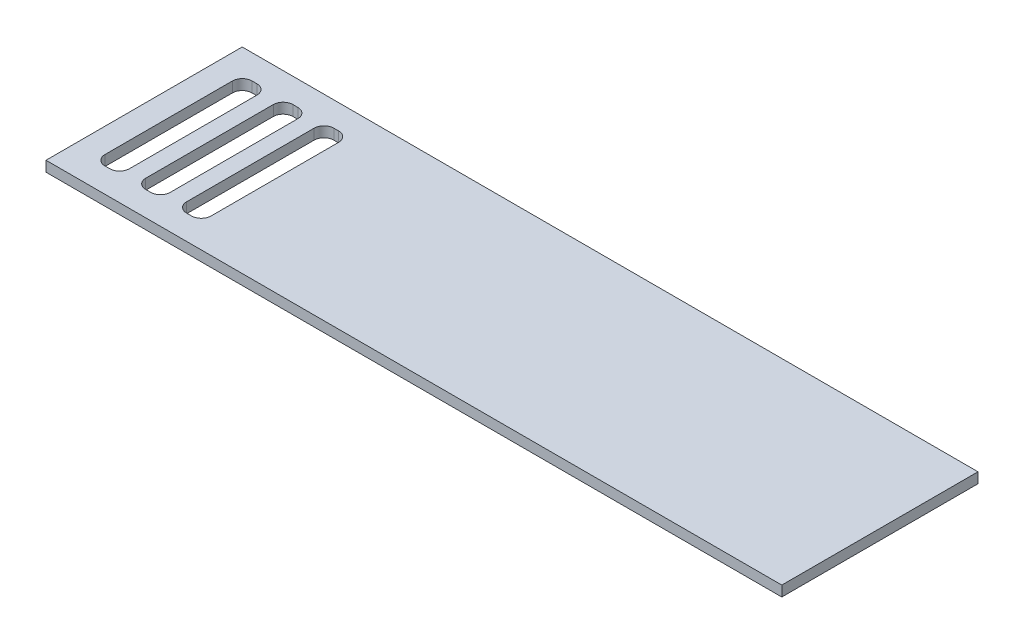
ISO-10303-21;
HEADER;
FILE_DESCRIPTION(('STEP AP214'),'2;1');
FILE_NAME('part.step','',(''),(''),'','','');
FILE_SCHEMA(('AUTOMOTIVE_DESIGN { 1 0 10303 214 1 1 1 1 }'));
ENDSEC;
DATA;
#1=APPLICATION_CONTEXT('core data for automotive mechanical design processes');
#2=APPLICATION_PROTOCOL_DEFINITION('international standard','automotive_design',2000,#1);
#3=PRODUCT_CONTEXT('',#1,'mechanical');
#4=PRODUCT('Part','Part','',(#3));
#5=PRODUCT_RELATED_PRODUCT_CATEGORY('part','',(#4));
#6=PRODUCT_DEFINITION_FORMATION('','',#4);
#7=PRODUCT_DEFINITION_CONTEXT('part definition',#1,'design');
#8=PRODUCT_DEFINITION('design','',#6,#7);
#9=PRODUCT_DEFINITION_SHAPE('','',#8);
#10=(LENGTH_UNIT() NAMED_UNIT(*) SI_UNIT(.MILLI.,.METRE.));
#11=(NAMED_UNIT(*) PLANE_ANGLE_UNIT() SI_UNIT($,.RADIAN.));
#12=(NAMED_UNIT(*) SI_UNIT($,.STERADIAN.) SOLID_ANGLE_UNIT());
#13=UNCERTAINTY_MEASURE_WITH_UNIT(LENGTH_MEASURE(1.E-05),#10,'distance_accuracy_value','');
#14=(GEOMETRIC_REPRESENTATION_CONTEXT(3) GLOBAL_UNCERTAINTY_ASSIGNED_CONTEXT((#13)) GLOBAL_UNIT_ASSIGNED_CONTEXT((#10,
#11,#12)) REPRESENTATION_CONTEXT('',''));
#15=CARTESIAN_POINT('',(0.,0.,0.));
#16=DIRECTION('',(0.,0.,1.));
#17=DIRECTION('',(1.,0.,0.));
#18=AXIS2_PLACEMENT_3D('',#15,#16,#17);
#19=CARTESIAN_POINT('',(0.,6.35,0.));
#20=DIRECTION('',(1.,0.,0.));
#21=DIRECTION('',(0.,0.,-1.));
#22=AXIS2_PLACEMENT_3D('',#19,#20,#21);
#23=PLANE('',#22);
#24=DIRECTION('',(0.,0.,1.));
#25=VECTOR('',#24,1.);
#26=CARTESIAN_POINT('',(0.,0.,0.));
#27=LINE('',#26,#25);
#28=CARTESIAN_POINT('',(0.,0.,-120.));
#29=VERTEX_POINT('',#28);
#30=CARTESIAN_POINT('',(0.,0.,0.));
#31=VERTEX_POINT('',#30);
#32=EDGE_CURVE('E259',#29,#31,#27,.T.);
#33=ORIENTED_EDGE('',*,*,#32,.T.);
#34=DIRECTION('',(0.,-1.,0.));
#35=VECTOR('',#34,1.);
#36=CARTESIAN_POINT('',(0.,6.35,0.));
#37=LINE('',#36,#35);
#38=CARTESIAN_POINT('',(0.,6.35,0.));
#39=VERTEX_POINT('',#38);
#40=EDGE_CURVE('E238',#39,#31,#37,.T.);
#41=ORIENTED_EDGE('',*,*,#40,.F.);
#42=DIRECTION('',(0.,0.,1.));
#43=VECTOR('',#42,1.);
#44=CARTESIAN_POINT('',(0.,6.35,0.));
#45=LINE('',#44,#43);
#46=CARTESIAN_POINT('',(0.,6.35,-120.));
#47=VERTEX_POINT('',#46);
#48=EDGE_CURVE('E246',#47,#39,#45,.T.);
#49=ORIENTED_EDGE('',*,*,#48,.F.);
#50=DIRECTION('',(0.,-1.,0.));
#51=VECTOR('',#50,1.);
#52=CARTESIAN_POINT('',(0.,6.35,-120.));
#53=LINE('',#52,#51);
#54=EDGE_CURVE('E515',#47,#29,#53,.T.);
#55=ORIENTED_EDGE('',*,*,#54,.T.);
#56=EDGE_LOOP('',(#33,#41,#49,#55));
#57=FACE_BOUND('',#56,.T.);
#58=ADVANCED_FACE('F48',(#57),#23,.F.);
#59=CARTESIAN_POINT('',(0.,6.35,0.));
#60=DIRECTION('',(0.,0.,-1.));
#61=DIRECTION('',(-1.,0.,0.));
#62=AXIS2_PLACEMENT_3D('',#59,#60,#61);
#63=PLANE('',#62);
#64=DIRECTION('',(1.,0.,0.));
#65=VECTOR('',#64,1.);
#66=CARTESIAN_POINT('',(0.,0.,0.));
#67=LINE('',#66,#65);
#68=CARTESIAN_POINT('',(450.,0.,0.));
#69=VERTEX_POINT('',#68);
#70=EDGE_CURVE('E518',#31,#69,#67,.T.);
#71=ORIENTED_EDGE('',*,*,#70,.T.);
#72=DIRECTION('',(0.,-1.,0.));
#73=VECTOR('',#72,1.);
#74=CARTESIAN_POINT('',(450.,6.35,0.));
#75=LINE('',#74,#73);
#76=CARTESIAN_POINT('',(450.,6.35,0.));
#77=VERTEX_POINT('',#76);
#78=EDGE_CURVE('E241',#77,#69,#75,.T.);
#79=ORIENTED_EDGE('',*,*,#78,.F.);
#80=DIRECTION('',(1.,0.,0.));
#81=VECTOR('',#80,1.);
#82=CARTESIAN_POINT('',(0.,6.35,0.));
#83=LINE('',#82,#81);
#84=EDGE_CURVE('E234',#39,#77,#83,.T.);
#85=ORIENTED_EDGE('',*,*,#84,.F.);
#86=ORIENTED_EDGE('',*,*,#40,.T.);
#87=EDGE_LOOP('',(#71,#79,#85,#86));
#88=FACE_BOUND('',#87,.T.);
#89=ADVANCED_FACE('F236',(#88),#63,.F.);
#90=CARTESIAN_POINT('',(450.,6.35,0.));
#91=DIRECTION('',(-1.,0.,0.));
#92=DIRECTION('',(0.,0.,1.));
#93=AXIS2_PLACEMENT_3D('',#90,#91,#92);
#94=PLANE('',#93);
#95=DIRECTION('',(0.,0.,-1.));
#96=VECTOR('',#95,1.);
#97=CARTESIAN_POINT('',(450.,0.,0.));
#98=LINE('',#97,#96);
#99=CARTESIAN_POINT('',(450.,0.,-120.));
#100=VERTEX_POINT('',#99);
#101=EDGE_CURVE('E521',#69,#100,#98,.T.);
#102=ORIENTED_EDGE('',*,*,#101,.T.);
#103=DIRECTION('',(0.,-1.,0.));
#104=VECTOR('',#103,1.);
#105=CARTESIAN_POINT('',(450.,6.35,-120.));
#106=LINE('',#105,#104);
#107=CARTESIAN_POINT('',(450.,6.35,-120.));
#108=VERTEX_POINT('',#107);
#109=EDGE_CURVE('E267',#108,#100,#106,.T.);
#110=ORIENTED_EDGE('',*,*,#109,.F.);
#111=DIRECTION('',(0.,0.,-1.));
#112=VECTOR('',#111,1.);
#113=CARTESIAN_POINT('',(450.,6.35,0.));
#114=LINE('',#113,#112);
#115=EDGE_CURVE('E245',#77,#108,#114,.T.);
#116=ORIENTED_EDGE('',*,*,#115,.F.);
#117=ORIENTED_EDGE('',*,*,#78,.T.);
#118=EDGE_LOOP('',(#102,#110,#116,#117));
#119=FACE_BOUND('',#118,.T.);
#120=ADVANCED_FACE('F536',(#119),#94,.F.);
#121=CARTESIAN_POINT('',(0.,6.35,-120.));
#122=DIRECTION('',(0.,0.,1.));
#123=DIRECTION('',(1.,0.,0.));
#124=AXIS2_PLACEMENT_3D('',#121,#122,#123);
#125=PLANE('',#124);
#126=DIRECTION('',(-1.,0.,0.));
#127=VECTOR('',#126,1.);
#128=CARTESIAN_POINT('',(0.,0.,-120.));
#129=LINE('',#128,#127);
#130=EDGE_CURVE('E256',#100,#29,#129,.T.);
#131=ORIENTED_EDGE('',*,*,#130,.T.);
#132=ORIENTED_EDGE('',*,*,#54,.F.);
#133=DIRECTION('',(-1.,0.,0.));
#134=VECTOR('',#133,1.);
#135=CARTESIAN_POINT('',(0.,6.35,-120.));
#136=LINE('',#135,#134);
#137=EDGE_CURVE('E251',#108,#47,#136,.T.);
#138=ORIENTED_EDGE('',*,*,#137,.F.);
#139=ORIENTED_EDGE('',*,*,#109,.T.);
#140=EDGE_LOOP('',(#131,#132,#138,#139));
#141=FACE_BOUND('',#140,.T.);
#142=ADVANCED_FACE('F532',(#141),#125,.F.);
#143=CARTESIAN_POINT('',(0.,6.35,0.));
#144=DIRECTION('',(0.,-1.,0.));
#145=DIRECTION('',(0.,0.,-1.));
#146=AXIS2_PLACEMENT_3D('',#143,#144,#145);
#147=PLANE('',#146);
#148=DIRECTION('',(-1.,0.,0.));
#149=VECTOR('',#148,1.);
#150=CARTESIAN_POINT('',(0.,6.35,-15.));
#151=LINE('',#150,#149);
#152=CARTESIAN_POINT('',(24.,6.35,-15.));
#153=VERTEX_POINT('',#152);
#154=CARTESIAN_POINT('',(21.,6.35,-15.));
#155=VERTEX_POINT('',#154);
#156=EDGE_CURVE('E499',#153,#155,#151,.T.);
#157=ORIENTED_EDGE('',*,*,#156,.T.);
#158=CARTESIAN_POINT('',(21.,6.35,-21.));
#159=DIRECTION('',(0.,-1.,0.));
#160=DIRECTION('',(0.,0.,-1.));
#161=AXIS2_PLACEMENT_3D('',#158,#159,#160);
#162=CIRCLE('',#161,6.);
#163=CARTESIAN_POINT('',(15.,6.35,-21.));
#164=VERTEX_POINT('',#163);
#165=EDGE_CURVE('E380',#155,#164,#162,.T.);
#166=ORIENTED_EDGE('',*,*,#165,.T.);
#167=DIRECTION('',(0.,0.,-1.));
#168=VECTOR('',#167,1.);
#169=CARTESIAN_POINT('',(15.,6.35,0.));
#170=LINE('',#169,#168);
#171=CARTESIAN_POINT('',(15.,6.35,-99.));
#172=VERTEX_POINT('',#171);
#173=EDGE_CURVE('E495',#164,#172,#170,.T.);
#174=ORIENTED_EDGE('',*,*,#173,.T.);
#175=CARTESIAN_POINT('',(21.,6.35,-99.));
#176=DIRECTION('',(0.,-1.,0.));
#177=DIRECTION('',(0.,0.,-1.));
#178=AXIS2_PLACEMENT_3D('',#175,#176,#177);
#179=CIRCLE('',#178,6.);
#180=CARTESIAN_POINT('',(21.,6.35,-105.));
#181=VERTEX_POINT('',#180);
#182=EDGE_CURVE('E386',#172,#181,#179,.T.);
#183=ORIENTED_EDGE('',*,*,#182,.T.);
#184=DIRECTION('',(1.,0.,0.));
#185=VECTOR('',#184,1.);
#186=CARTESIAN_POINT('',(0.,6.35,-105.));
#187=LINE('',#186,#185);
#188=CARTESIAN_POINT('',(24.,6.35,-105.));
#189=VERTEX_POINT('',#188);
#190=EDGE_CURVE('E507',#181,#189,#187,.T.);
#191=ORIENTED_EDGE('',*,*,#190,.T.);
#192=CARTESIAN_POINT('',(24.,6.35,-99.));
#193=DIRECTION('',(0.,-1.,0.));
#194=DIRECTION('',(0.,0.,-1.));
#195=AXIS2_PLACEMENT_3D('',#192,#193,#194);
#196=CIRCLE('',#195,6.);
#197=CARTESIAN_POINT('',(30.,6.35,-99.));
#198=VERTEX_POINT('',#197);
#199=EDGE_CURVE('E403',#189,#198,#196,.T.);
#200=ORIENTED_EDGE('',*,*,#199,.T.);
#201=DIRECTION('',(0.,0.,1.));
#202=VECTOR('',#201,1.);
#203=CARTESIAN_POINT('',(30.,6.35,0.));
#204=LINE('',#203,#202);
#205=CARTESIAN_POINT('',(30.,6.35,-21.));
#206=VERTEX_POINT('',#205);
#207=EDGE_CURVE('E503',#198,#206,#204,.T.);
#208=ORIENTED_EDGE('',*,*,#207,.T.);
#209=CARTESIAN_POINT('',(24.,6.35,-21.));
#210=DIRECTION('',(0.,-1.,0.));
#211=DIRECTION('',(0.,0.,-1.));
#212=AXIS2_PLACEMENT_3D('',#209,#210,#211);
#213=CIRCLE('',#212,6.);
#214=EDGE_CURVE('E362',#206,#153,#213,.T.);
#215=ORIENTED_EDGE('',*,*,#214,.T.);
#216=EDGE_LOOP('',(#157,#166,#174,#183,#191,#200,#208,#215));
#217=FACE_BOUND('',#216,.T.);
#218=DIRECTION('',(-1.,0.,0.));
#219=VECTOR('',#218,1.);
#220=CARTESIAN_POINT('',(0.,6.35,-15.));
#221=LINE('',#220,#219);
#222=CARTESIAN_POINT('',(74.,6.35,-15.));
#223=VERTEX_POINT('',#222);
#224=CARTESIAN_POINT('',(71.,6.35,-15.));
#225=VERTEX_POINT('',#224);
#226=EDGE_CURVE('E427',#223,#225,#221,.T.);
#227=ORIENTED_EDGE('',*,*,#226,.T.);
#228=CARTESIAN_POINT('',(71.,6.35,-21.));
#229=DIRECTION('',(0.,-1.,0.));
#230=DIRECTION('',(0.,0.,-1.));
#231=AXIS2_PLACEMENT_3D('',#228,#229,#230);
#232=CIRCLE('',#231,6.);
#233=CARTESIAN_POINT('',(65.,6.35,-21.));
#234=VERTEX_POINT('',#233);
#235=EDGE_CURVE('E368',#225,#234,#232,.T.);
#236=ORIENTED_EDGE('',*,*,#235,.T.);
#237=DIRECTION('',(0.,0.,-1.));
#238=VECTOR('',#237,1.);
#239=CARTESIAN_POINT('',(65.,6.35,0.));
#240=LINE('',#239,#238);
#241=CARTESIAN_POINT('',(65.,6.35,-99.));
#242=VERTEX_POINT('',#241);
#243=EDGE_CURVE('E488',#234,#242,#240,.T.);
#244=ORIENTED_EDGE('',*,*,#243,.T.);
#245=CARTESIAN_POINT('',(71.,6.35,-99.));
#246=DIRECTION('',(0.,-1.,0.));
#247=DIRECTION('',(0.,0.,-1.));
#248=AXIS2_PLACEMENT_3D('',#245,#246,#247);
#249=CIRCLE('',#248,6.);
#250=CARTESIAN_POINT('',(71.,6.35,-105.));
#251=VERTEX_POINT('',#250);
#252=EDGE_CURVE('E71',#242,#251,#249,.T.);
#253=ORIENTED_EDGE('',*,*,#252,.T.);
#254=DIRECTION('',(1.,0.,0.));
#255=VECTOR('',#254,1.);
#256=CARTESIAN_POINT('',(0.,6.35,-105.));
#257=LINE('',#256,#255);
#258=CARTESIAN_POINT('',(74.,6.35,-105.));
#259=VERTEX_POINT('',#258);
#260=EDGE_CURVE('E420',#251,#259,#257,.T.);
#261=ORIENTED_EDGE('',*,*,#260,.T.);
#262=CARTESIAN_POINT('',(74.,6.35,-99.));
#263=DIRECTION('',(0.,-1.,0.));
#264=DIRECTION('',(0.,0.,-1.));
#265=AXIS2_PLACEMENT_3D('',#262,#263,#264);
#266=CIRCLE('',#265,6.);
#267=CARTESIAN_POINT('',(80.,6.35,-99.));
#268=VERTEX_POINT('',#267);
#269=EDGE_CURVE('E57',#259,#268,#266,.T.);
#270=ORIENTED_EDGE('',*,*,#269,.T.);
#271=DIRECTION('',(0.,0.,1.));
#272=VECTOR('',#271,1.);
#273=CARTESIAN_POINT('',(80.,6.35,0.));
#274=LINE('',#273,#272);
#275=CARTESIAN_POINT('',(80.,6.35,-21.));
#276=VERTEX_POINT('',#275);
#277=EDGE_CURVE('E419',#268,#276,#274,.T.);
#278=ORIENTED_EDGE('',*,*,#277,.T.);
#279=CARTESIAN_POINT('',(74.,6.35,-21.));
#280=DIRECTION('',(0.,-1.,0.));
#281=DIRECTION('',(0.,0.,-1.));
#282=AXIS2_PLACEMENT_3D('',#279,#280,#281);
#283=CIRCLE('',#282,6.);
#284=EDGE_CURVE('E350',#276,#223,#283,.T.);
#285=ORIENTED_EDGE('',*,*,#284,.T.);
#286=EDGE_LOOP('',(#227,#236,#244,#253,#261,#270,#278,#285));
#287=FACE_BOUND('',#286,.T.);
#288=DIRECTION('',(0.,0.,1.));
#289=VECTOR('',#288,1.);
#290=CARTESIAN_POINT('',(55.,6.35,0.));
#291=LINE('',#290,#289);
#292=CARTESIAN_POINT('',(55.,6.35,-99.));
#293=VERTEX_POINT('',#292);
#294=CARTESIAN_POINT('',(55.,6.35,-21.));
#295=VERTEX_POINT('',#294);
#296=EDGE_CURVE('E475',#293,#295,#291,.T.);
#297=ORIENTED_EDGE('',*,*,#296,.T.);
#298=CARTESIAN_POINT('',(49.,6.35,-21.));
#299=DIRECTION('',(0.,-1.,0.));
#300=DIRECTION('',(0.,0.,-1.));
#301=AXIS2_PLACEMENT_3D('',#298,#299,#300);
#302=CIRCLE('',#301,6.);
#303=CARTESIAN_POINT('',(49.,6.35,-15.));
#304=VERTEX_POINT('',#303);
#305=EDGE_CURVE('E356',#295,#304,#302,.T.);
#306=ORIENTED_EDGE('',*,*,#305,.T.);
#307=DIRECTION('',(-1.,0.,0.));
#308=VECTOR('',#307,1.);
#309=CARTESIAN_POINT('',(0.,6.35,-15.));
#310=LINE('',#309,#308);
#311=CARTESIAN_POINT('',(46.,6.35,-15.));
#312=VERTEX_POINT('',#311);
#313=EDGE_CURVE('E471',#304,#312,#310,.T.);
#314=ORIENTED_EDGE('',*,*,#313,.T.);
#315=CARTESIAN_POINT('',(46.,6.35,-21.));
#316=DIRECTION('',(0.,-1.,0.));
#317=DIRECTION('',(0.,0.,-1.));
#318=AXIS2_PLACEMENT_3D('',#315,#316,#317);
#319=CIRCLE('',#318,6.);
#320=CARTESIAN_POINT('',(40.,6.35,-21.));
#321=VERTEX_POINT('',#320);
#322=EDGE_CURVE('E374',#312,#321,#319,.T.);
#323=ORIENTED_EDGE('',*,*,#322,.T.);
#324=DIRECTION('',(0.,0.,-1.));
#325=VECTOR('',#324,1.);
#326=CARTESIAN_POINT('',(40.,6.35,0.));
#327=LINE('',#326,#325);
#328=CARTESIAN_POINT('',(40.,6.35,-99.));
#329=VERTEX_POINT('',#328);
#330=EDGE_CURVE('E484',#321,#329,#327,.T.);
#331=ORIENTED_EDGE('',*,*,#330,.T.);
#332=CARTESIAN_POINT('',(46.,6.35,-99.));
#333=DIRECTION('',(0.,-1.,0.));
#334=DIRECTION('',(0.,0.,-1.));
#335=AXIS2_PLACEMENT_3D('',#332,#333,#334);
#336=CIRCLE('',#335,6.);
#337=CARTESIAN_POINT('',(46.,6.35,-105.));
#338=VERTEX_POINT('',#337);
#339=EDGE_CURVE('E392',#329,#338,#336,.T.);
#340=ORIENTED_EDGE('',*,*,#339,.T.);
#341=DIRECTION('',(1.,0.,0.));
#342=VECTOR('',#341,1.);
#343=CARTESIAN_POINT('',(0.,6.35,-105.));
#344=LINE('',#343,#342);
#345=CARTESIAN_POINT('',(49.,6.35,-105.));
#346=VERTEX_POINT('',#345);
#347=EDGE_CURVE('E480',#338,#346,#344,.T.);
#348=ORIENTED_EDGE('',*,*,#347,.T.);
#349=CARTESIAN_POINT('',(49.,6.35,-99.));
#350=DIRECTION('',(0.,-1.,0.));
#351=DIRECTION('',(0.,0.,-1.));
#352=AXIS2_PLACEMENT_3D('',#349,#350,#351);
#353=CIRCLE('',#352,6.);
#354=EDGE_CURVE('E409',#346,#293,#353,.T.);
#355=ORIENTED_EDGE('',*,*,#354,.T.);
#356=EDGE_LOOP('',(#297,#306,#314,#323,#331,#340,#348,#355));
#357=FACE_BOUND('',#356,.T.);
#358=ORIENTED_EDGE('',*,*,#48,.T.);
#359=ORIENTED_EDGE('',*,*,#84,.T.);
#360=ORIENTED_EDGE('',*,*,#115,.T.);
#361=ORIENTED_EDGE('',*,*,#137,.T.);
#362=EDGE_LOOP('',(#358,#359,#360,#361));
#363=FACE_BOUND('',#362,.T.);
#364=ADVANCED_FACE('F249',(#217,#287,#357,#363),#147,.F.);
#365=CARTESIAN_POINT('',(0.,0.,0.));
#366=DIRECTION('',(0.,-1.,0.));
#367=DIRECTION('',(0.,0.,-1.));
#368=AXIS2_PLACEMENT_3D('',#365,#366,#367);
#369=PLANE('',#368);
#370=DIRECTION('',(0.,0.,-1.));
#371=VECTOR('',#370,1.);
#372=CARTESIAN_POINT('',(30.,0.,-105.));
#373=LINE('',#372,#371);
#374=CARTESIAN_POINT('',(30.,0.,-21.));
#375=VERTEX_POINT('',#374);
#376=CARTESIAN_POINT('',(30.,0.,-99.));
#377=VERTEX_POINT('',#376);
#378=EDGE_CURVE('E476',#375,#377,#373,.T.);
#379=ORIENTED_EDGE('',*,*,#378,.T.);
#380=CARTESIAN_POINT('',(24.,0.,-99.));
#381=DIRECTION('',(0.,-1.,0.));
#382=DIRECTION('',(0.,0.,-1.));
#383=AXIS2_PLACEMENT_3D('',#380,#381,#382);
#384=CIRCLE('',#383,6.);
#385=CARTESIAN_POINT('',(24.,0.,-105.));
#386=VERTEX_POINT('',#385);
#387=EDGE_CURVE('E406',#377,#386,#384,.F.);
#388=ORIENTED_EDGE('',*,*,#387,.T.);
#389=DIRECTION('',(-1.,0.,0.));
#390=VECTOR('',#389,1.);
#391=CARTESIAN_POINT('',(15.,0.,-105.));
#392=LINE('',#391,#390);
#393=CARTESIAN_POINT('',(21.,0.,-105.));
#394=VERTEX_POINT('',#393);
#395=EDGE_CURVE('E442',#386,#394,#392,.T.);
#396=ORIENTED_EDGE('',*,*,#395,.T.);
#397=CARTESIAN_POINT('',(21.,0.,-99.));
#398=DIRECTION('',(0.,-1.,0.));
#399=DIRECTION('',(0.,0.,-1.));
#400=AXIS2_PLACEMENT_3D('',#397,#398,#399);
#401=CIRCLE('',#400,6.);
#402=CARTESIAN_POINT('',(15.,0.,-99.));
#403=VERTEX_POINT('',#402);
#404=EDGE_CURVE('E389',#394,#403,#401,.F.);
#405=ORIENTED_EDGE('',*,*,#404,.T.);
#406=DIRECTION('',(0.,0.,1.));
#407=VECTOR('',#406,1.);
#408=CARTESIAN_POINT('',(15.,0.,-15.));
#409=LINE('',#408,#407);
#410=CARTESIAN_POINT('',(15.,0.,-21.));
#411=VERTEX_POINT('',#410);
#412=EDGE_CURVE('E448',#403,#411,#409,.T.);
#413=ORIENTED_EDGE('',*,*,#412,.T.);
#414=CARTESIAN_POINT('',(21.,0.,-21.));
#415=DIRECTION('',(0.,-1.,0.));
#416=DIRECTION('',(0.,0.,-1.));
#417=AXIS2_PLACEMENT_3D('',#414,#415,#416);
#418=CIRCLE('',#417,6.);
#419=CARTESIAN_POINT('',(21.,0.,-15.));
#420=VERTEX_POINT('',#419);
#421=EDGE_CURVE('E383',#411,#420,#418,.F.);
#422=ORIENTED_EDGE('',*,*,#421,.T.);
#423=DIRECTION('',(1.,0.,0.));
#424=VECTOR('',#423,1.);
#425=CARTESIAN_POINT('',(30.,0.,-15.));
#426=LINE('',#425,#424);
#427=CARTESIAN_POINT('',(24.,0.,-15.));
#428=VERTEX_POINT('',#427);
#429=EDGE_CURVE('E677',#420,#428,#426,.T.);
#430=ORIENTED_EDGE('',*,*,#429,.T.);
#431=CARTESIAN_POINT('',(24.,0.,-21.));
#432=DIRECTION('',(0.,-1.,0.));
#433=DIRECTION('',(0.,0.,-1.));
#434=AXIS2_PLACEMENT_3D('',#431,#432,#433);
#435=CIRCLE('',#434,6.);
#436=EDGE_CURVE('E365',#428,#375,#435,.F.);
#437=ORIENTED_EDGE('',*,*,#436,.T.);
#438=EDGE_LOOP('',(#379,#388,#396,#405,#413,#422,#430,#437));
#439=FACE_BOUND('',#438,.T.);
#440=DIRECTION('',(0.,0.,-1.));
#441=VECTOR('',#440,1.);
#442=CARTESIAN_POINT('',(80.,0.,-15.));
#443=LINE('',#442,#441);
#444=CARTESIAN_POINT('',(80.,0.,-21.));
#445=VERTEX_POINT('',#444);
#446=CARTESIAN_POINT('',(80.,0.,-99.));
#447=VERTEX_POINT('',#446);
#448=EDGE_CURVE('E437',#445,#447,#443,.T.);
#449=ORIENTED_EDGE('',*,*,#448,.T.);
#450=CARTESIAN_POINT('',(74.,0.,-99.));
#451=DIRECTION('',(0.,-1.,0.));
#452=DIRECTION('',(0.,0.,-1.));
#453=AXIS2_PLACEMENT_3D('',#450,#451,#452);
#454=CIRCLE('',#453,6.);
#455=CARTESIAN_POINT('',(74.,0.,-105.));
#456=VERTEX_POINT('',#455);
#457=EDGE_CURVE('E11',#447,#456,#454,.F.);
#458=ORIENTED_EDGE('',*,*,#457,.T.);
#459=DIRECTION('',(-1.,0.,0.));
#460=VECTOR('',#459,1.);
#461=CARTESIAN_POINT('',(80.,0.,-105.));
#462=LINE('',#461,#460);
#463=CARTESIAN_POINT('',(71.,0.,-105.));
#464=VERTEX_POINT('',#463);
#465=EDGE_CURVE('E435',#456,#464,#462,.T.);
#466=ORIENTED_EDGE('',*,*,#465,.T.);
#467=CARTESIAN_POINT('',(71.,0.,-99.));
#468=DIRECTION('',(0.,-1.,0.));
#469=DIRECTION('',(0.,0.,-1.));
#470=AXIS2_PLACEMENT_3D('',#467,#468,#469);
#471=CIRCLE('',#470,6.);
#472=CARTESIAN_POINT('',(65.,0.,-99.));
#473=VERTEX_POINT('',#472);
#474=EDGE_CURVE('E400',#464,#473,#471,.F.);
#475=ORIENTED_EDGE('',*,*,#474,.T.);
#476=DIRECTION('',(0.,0.,1.));
#477=VECTOR('',#476,1.);
#478=CARTESIAN_POINT('',(65.,0.,-105.));
#479=LINE('',#478,#477);
#480=CARTESIAN_POINT('',(65.,0.,-21.));
#481=VERTEX_POINT('',#480);
#482=EDGE_CURVE('E443',#473,#481,#479,.T.);
#483=ORIENTED_EDGE('',*,*,#482,.T.);
#484=CARTESIAN_POINT('',(71.,0.,-21.));
#485=DIRECTION('',(0.,-1.,0.));
#486=DIRECTION('',(0.,0.,-1.));
#487=AXIS2_PLACEMENT_3D('',#484,#485,#486);
#488=CIRCLE('',#487,6.);
#489=CARTESIAN_POINT('',(71.,0.,-15.));
#490=VERTEX_POINT('',#489);
#491=EDGE_CURVE('E371',#481,#490,#488,.F.);
#492=ORIENTED_EDGE('',*,*,#491,.T.);
#493=DIRECTION('',(1.,0.,0.));
#494=VECTOR('',#493,1.);
#495=CARTESIAN_POINT('',(65.,0.,-15.));
#496=LINE('',#495,#494);
#497=CARTESIAN_POINT('',(74.,0.,-15.));
#498=VERTEX_POINT('',#497);
#499=EDGE_CURVE('E451',#490,#498,#496,.T.);
#500=ORIENTED_EDGE('',*,*,#499,.T.);
#501=CARTESIAN_POINT('',(74.,0.,-21.));
#502=DIRECTION('',(0.,-1.,0.));
#503=DIRECTION('',(0.,0.,-1.));
#504=AXIS2_PLACEMENT_3D('',#501,#502,#503);
#505=CIRCLE('',#504,6.);
#506=EDGE_CURVE('E353',#498,#445,#505,.F.);
#507=ORIENTED_EDGE('',*,*,#506,.T.);
#508=EDGE_LOOP('',(#449,#458,#466,#475,#483,#492,#500,#507));
#509=FACE_BOUND('',#508,.T.);
#510=DIRECTION('',(-1.,0.,0.));
#511=VECTOR('',#510,1.);
#512=CARTESIAN_POINT('',(40.,0.,-105.));
#513=LINE('',#512,#511);
#514=CARTESIAN_POINT('',(49.,0.,-105.));
#515=VERTEX_POINT('',#514);
#516=CARTESIAN_POINT('',(46.,0.,-105.));
#517=VERTEX_POINT('',#516);
#518=EDGE_CURVE('E455',#515,#517,#513,.T.);
#519=ORIENTED_EDGE('',*,*,#518,.T.);
#520=CARTESIAN_POINT('',(46.,0.,-99.));
#521=DIRECTION('',(0.,-1.,0.));
#522=DIRECTION('',(0.,0.,-1.));
#523=AXIS2_PLACEMENT_3D('',#520,#521,#522);
#524=CIRCLE('',#523,6.);
#525=CARTESIAN_POINT('',(40.,0.,-99.));
#526=VERTEX_POINT('',#525);
#527=EDGE_CURVE('E395',#517,#526,#524,.F.);
#528=ORIENTED_EDGE('',*,*,#527,.T.);
#529=DIRECTION('',(0.,0.,1.));
#530=VECTOR('',#529,1.);
#531=CARTESIAN_POINT('',(40.,0.,-15.));
#532=LINE('',#531,#530);
#533=CARTESIAN_POINT('',(40.,0.,-21.));
#534=VERTEX_POINT('',#533);
#535=EDGE_CURVE('E467',#526,#534,#532,.T.);
#536=ORIENTED_EDGE('',*,*,#535,.T.);
#537=CARTESIAN_POINT('',(46.,0.,-21.));
#538=DIRECTION('',(0.,-1.,0.));
#539=DIRECTION('',(0.,0.,-1.));
#540=AXIS2_PLACEMENT_3D('',#537,#538,#539);
#541=CIRCLE('',#540,6.);
#542=CARTESIAN_POINT('',(46.,0.,-15.));
#543=VERTEX_POINT('',#542);
#544=EDGE_CURVE('E377',#534,#543,#541,.F.);
#545=ORIENTED_EDGE('',*,*,#544,.T.);
#546=DIRECTION('',(1.,0.,0.));
#547=VECTOR('',#546,1.);
#548=CARTESIAN_POINT('',(55.,0.,-15.));
#549=LINE('',#548,#547);
#550=CARTESIAN_POINT('',(49.,0.,-15.));
#551=VERTEX_POINT('',#550);
#552=EDGE_CURVE('E463',#543,#551,#549,.T.);
#553=ORIENTED_EDGE('',*,*,#552,.T.);
#554=CARTESIAN_POINT('',(49.,0.,-21.));
#555=DIRECTION('',(0.,-1.,0.));
#556=DIRECTION('',(0.,0.,-1.));
#557=AXIS2_PLACEMENT_3D('',#554,#555,#556);
#558=CIRCLE('',#557,6.);
#559=CARTESIAN_POINT('',(55.,0.,-21.));
#560=VERTEX_POINT('',#559);
#561=EDGE_CURVE('E359',#551,#560,#558,.F.);
#562=ORIENTED_EDGE('',*,*,#561,.T.);
#563=DIRECTION('',(0.,0.,-1.));
#564=VECTOR('',#563,1.);
#565=CARTESIAN_POINT('',(55.,0.,-105.));
#566=LINE('',#565,#564);
#567=CARTESIAN_POINT('',(55.,0.,-99.));
#568=VERTEX_POINT('',#567);
#569=EDGE_CURVE('E459',#560,#568,#566,.T.);
#570=ORIENTED_EDGE('',*,*,#569,.T.);
#571=CARTESIAN_POINT('',(49.,0.,-99.));
#572=DIRECTION('',(0.,-1.,0.));
#573=DIRECTION('',(0.,0.,-1.));
#574=AXIS2_PLACEMENT_3D('',#571,#572,#573);
#575=CIRCLE('',#574,6.);
#576=EDGE_CURVE('E412',#568,#515,#575,.F.);
#577=ORIENTED_EDGE('',*,*,#576,.T.);
#578=EDGE_LOOP('',(#519,#528,#536,#545,#553,#562,#570,#577));
#579=FACE_BOUND('',#578,.T.);
#580=ORIENTED_EDGE('',*,*,#32,.F.);
#581=ORIENTED_EDGE('',*,*,#130,.F.);
#582=ORIENTED_EDGE('',*,*,#101,.F.);
#583=ORIENTED_EDGE('',*,*,#70,.F.);
#584=EDGE_LOOP('',(#580,#581,#582,#583));
#585=FACE_BOUND('',#584,.T.);
#586=ADVANCED_FACE('F433',(#439,#509,#579,#585),#369,.T.);
#587=CARTESIAN_POINT('',(40.,0.,-15.));
#588=DIRECTION('',(-1.,0.,0.));
#589=DIRECTION('',(0.,0.,1.));
#590=AXIS2_PLACEMENT_3D('',#587,#588,#589);
#591=PLANE('',#590);
#592=ORIENTED_EDGE('',*,*,#330,.F.);
#593=DIRECTION('',(0.,1.,0.));
#594=VECTOR('',#593,1.);
#595=CARTESIAN_POINT('',(40.,0.,-21.));
#596=LINE('',#595,#594);
#597=EDGE_CURVE('E320',#321,#534,#596,.F.);
#598=ORIENTED_EDGE('',*,*,#597,.T.);
#599=ORIENTED_EDGE('',*,*,#535,.F.);
#600=DIRECTION('',(0.,1.,0.));
#601=VECTOR('',#600,1.);
#602=CARTESIAN_POINT('',(40.,6.35,-99.));
#603=LINE('',#602,#601);
#604=EDGE_CURVE('E316',#526,#329,#603,.T.);
#605=ORIENTED_EDGE('',*,*,#604,.T.);
#606=EDGE_LOOP('',(#592,#598,#599,#605));
#607=FACE_BOUND('',#606,.T.);
#608=ADVANCED_FACE('F611',(#607),#591,.F.);
#609=CARTESIAN_POINT('',(40.,0.,-105.));
#610=DIRECTION('',(0.,0.,-1.));
#611=DIRECTION('',(-1.,0.,0.));
#612=AXIS2_PLACEMENT_3D('',#609,#610,#611);
#613=PLANE('',#612);
#614=ORIENTED_EDGE('',*,*,#347,.F.);
#615=DIRECTION('',(0.,1.,0.));
#616=VECTOR('',#615,1.);
#617=CARTESIAN_POINT('',(46.,0.,-105.));
#618=LINE('',#617,#616);
#619=EDGE_CURVE('E341',#338,#517,#618,.F.);
#620=ORIENTED_EDGE('',*,*,#619,.T.);
#621=ORIENTED_EDGE('',*,*,#518,.F.);
#622=DIRECTION('',(0.,1.,0.));
#623=VECTOR('',#622,1.);
#624=CARTESIAN_POINT('',(49.,6.35,-105.));
#625=LINE('',#624,#623);
#626=EDGE_CURVE('E337',#515,#346,#625,.T.);
#627=ORIENTED_EDGE('',*,*,#626,.T.);
#628=EDGE_LOOP('',(#614,#620,#621,#627));
#629=FACE_BOUND('',#628,.T.);
#630=ADVANCED_FACE('F604',(#629),#613,.F.);
#631=CARTESIAN_POINT('',(55.,0.,-105.));
#632=DIRECTION('',(1.,0.,0.));
#633=DIRECTION('',(0.,0.,-1.));
#634=AXIS2_PLACEMENT_3D('',#631,#632,#633);
#635=PLANE('',#634);
#636=ORIENTED_EDGE('',*,*,#569,.F.);
#637=DIRECTION('',(0.,1.,0.));
#638=VECTOR('',#637,1.);
#639=CARTESIAN_POINT('',(55.,6.35,-21.));
#640=LINE('',#639,#638);
#641=EDGE_CURVE('E284',#560,#295,#640,.T.);
#642=ORIENTED_EDGE('',*,*,#641,.T.);
#643=ORIENTED_EDGE('',*,*,#296,.F.);
#644=DIRECTION('',(0.,1.,0.));
#645=VECTOR('',#644,1.);
#646=CARTESIAN_POINT('',(55.,0.,-99.));
#647=LINE('',#646,#645);
#648=EDGE_CURVE('E281',#293,#568,#647,.F.);
#649=ORIENTED_EDGE('',*,*,#648,.T.);
#650=EDGE_LOOP('',(#636,#642,#643,#649));
#651=FACE_BOUND('',#650,.T.);
#652=ADVANCED_FACE('F622',(#651),#635,.F.);
#653=CARTESIAN_POINT('',(55.,0.,-15.));
#654=DIRECTION('',(0.,0.,1.));
#655=DIRECTION('',(1.,0.,0.));
#656=AXIS2_PLACEMENT_3D('',#653,#654,#655);
#657=PLANE('',#656);
#658=ORIENTED_EDGE('',*,*,#313,.F.);
#659=DIRECTION('',(0.,1.,0.));
#660=VECTOR('',#659,1.);
#661=CARTESIAN_POINT('',(49.,0.,-15.));
#662=LINE('',#661,#660);
#663=EDGE_CURVE('E292',#304,#551,#662,.F.);
#664=ORIENTED_EDGE('',*,*,#663,.T.);
#665=ORIENTED_EDGE('',*,*,#552,.F.);
#666=DIRECTION('',(0.,1.,0.));
#667=VECTOR('',#666,1.);
#668=CARTESIAN_POINT('',(46.,6.35,-15.));
#669=LINE('',#668,#667);
#670=EDGE_CURVE('E288',#543,#312,#669,.T.);
#671=ORIENTED_EDGE('',*,*,#670,.T.);
#672=EDGE_LOOP('',(#658,#664,#665,#671));
#673=FACE_BOUND('',#672,.T.);
#674=ADVANCED_FACE('F618',(#673),#657,.F.);
#675=CARTESIAN_POINT('',(80.,0.,-105.));
#676=DIRECTION('',(0.,0.,-1.));
#677=DIRECTION('',(-1.,0.,0.));
#678=AXIS2_PLACEMENT_3D('',#675,#676,#677);
#679=PLANE('',#678);
#680=ORIENTED_EDGE('',*,*,#260,.F.);
#681=DIRECTION('',(0.,1.,0.));
#682=VECTOR('',#681,1.);
#683=CARTESIAN_POINT('',(71.,0.,-105.));
#684=LINE('',#683,#682);
#685=EDGE_CURVE('E347',#251,#464,#684,.F.);
#686=ORIENTED_EDGE('',*,*,#685,.T.);
#687=ORIENTED_EDGE('',*,*,#465,.F.);
#688=DIRECTION('',(0.,1.,0.));
#689=VECTOR('',#688,1.);
#690=CARTESIAN_POINT('',(74.,6.35,-105.));
#691=LINE('',#690,#689);
#692=EDGE_CURVE('E344',#456,#259,#691,.T.);
#693=ORIENTED_EDGE('',*,*,#692,.T.);
#694=EDGE_LOOP('',(#680,#686,#687,#693));
#695=FACE_BOUND('',#694,.T.);
#696=ADVANCED_FACE('F439',(#695),#679,.F.);
#697=CARTESIAN_POINT('',(80.,0.,-15.));
#698=DIRECTION('',(1.,0.,0.));
#699=DIRECTION('',(0.,0.,-1.));
#700=AXIS2_PLACEMENT_3D('',#697,#698,#699);
#701=PLANE('',#700);
#702=ORIENTED_EDGE('',*,*,#448,.F.);
#703=DIRECTION('',(0.,1.,0.));
#704=VECTOR('',#703,1.);
#705=CARTESIAN_POINT('',(80.,6.35,-21.));
#706=LINE('',#705,#704);
#707=EDGE_CURVE('E265',#445,#276,#706,.T.);
#708=ORIENTED_EDGE('',*,*,#707,.T.);
#709=ORIENTED_EDGE('',*,*,#277,.F.);
#710=DIRECTION('',(0.,1.,0.));
#711=VECTOR('',#710,1.);
#712=CARTESIAN_POINT('',(80.,0.,-99.));
#713=LINE('',#712,#711);
#714=EDGE_CURVE('E261',#268,#447,#713,.F.);
#715=ORIENTED_EDGE('',*,*,#714,.T.);
#716=EDGE_LOOP('',(#702,#708,#709,#715));
#717=FACE_BOUND('',#716,.T.);
#718=ADVANCED_FACE('F423',(#717),#701,.F.);
#719=CARTESIAN_POINT('',(65.,0.,-15.));
#720=DIRECTION('',(0.,0.,1.));
#721=DIRECTION('',(1.,0.,0.));
#722=AXIS2_PLACEMENT_3D('',#719,#720,#721);
#723=PLANE('',#722);
#724=ORIENTED_EDGE('',*,*,#226,.F.);
#725=DIRECTION('',(0.,1.,0.));
#726=VECTOR('',#725,1.);
#727=CARTESIAN_POINT('',(74.,0.,-15.));
#728=LINE('',#727,#726);
#729=EDGE_CURVE('E278',#223,#498,#728,.F.);
#730=ORIENTED_EDGE('',*,*,#729,.T.);
#731=ORIENTED_EDGE('',*,*,#499,.F.);
#732=DIRECTION('',(0.,1.,0.));
#733=VECTOR('',#732,1.);
#734=CARTESIAN_POINT('',(71.,6.35,-15.));
#735=LINE('',#734,#733);
#736=EDGE_CURVE('E274',#490,#225,#735,.T.);
#737=ORIENTED_EDGE('',*,*,#736,.T.);
#738=EDGE_LOOP('',(#724,#730,#731,#737));
#739=FACE_BOUND('',#738,.T.);
#740=ADVANCED_FACE('F644',(#739),#723,.F.);
#741=CARTESIAN_POINT('',(65.,0.,-105.));
#742=DIRECTION('',(-1.,0.,0.));
#743=DIRECTION('',(0.,0.,1.));
#744=AXIS2_PLACEMENT_3D('',#741,#742,#743);
#745=PLANE('',#744);
#746=ORIENTED_EDGE('',*,*,#243,.F.);
#747=DIRECTION('',(0.,1.,0.));
#748=VECTOR('',#747,1.);
#749=CARTESIAN_POINT('',(65.,0.,-21.));
#750=LINE('',#749,#748);
#751=EDGE_CURVE('E313',#234,#481,#750,.F.);
#752=ORIENTED_EDGE('',*,*,#751,.T.);
#753=ORIENTED_EDGE('',*,*,#482,.F.);
#754=DIRECTION('',(0.,1.,0.));
#755=VECTOR('',#754,1.);
#756=CARTESIAN_POINT('',(65.,6.35,-99.));
#757=LINE('',#756,#755);
#758=EDGE_CURVE('E309',#473,#242,#757,.T.);
#759=ORIENTED_EDGE('',*,*,#758,.T.);
#760=EDGE_LOOP('',(#746,#752,#753,#759));
#761=FACE_BOUND('',#760,.T.);
#762=ADVANCED_FACE('F647',(#761),#745,.F.);
#763=CARTESIAN_POINT('',(15.,0.,-105.));
#764=DIRECTION('',(0.,0.,-1.));
#765=DIRECTION('',(-1.,0.,0.));
#766=AXIS2_PLACEMENT_3D('',#763,#764,#765);
#767=PLANE('',#766);
#768=ORIENTED_EDGE('',*,*,#190,.F.);
#769=DIRECTION('',(0.,1.,0.));
#770=VECTOR('',#769,1.);
#771=CARTESIAN_POINT('',(21.,0.,-105.));
#772=LINE('',#771,#770);
#773=EDGE_CURVE('E334',#181,#394,#772,.F.);
#774=ORIENTED_EDGE('',*,*,#773,.T.);
#775=ORIENTED_EDGE('',*,*,#395,.F.);
#776=DIRECTION('',(0.,1.,0.));
#777=VECTOR('',#776,1.);
#778=CARTESIAN_POINT('',(24.,6.35,-105.));
#779=LINE('',#778,#777);
#780=EDGE_CURVE('E330',#386,#189,#779,.T.);
#781=ORIENTED_EDGE('',*,*,#780,.T.);
#782=EDGE_LOOP('',(#768,#774,#775,#781));
#783=FACE_BOUND('',#782,.T.);
#784=ADVANCED_FACE('F651',(#783),#767,.F.);
#785=CARTESIAN_POINT('',(30.,0.,-105.));
#786=DIRECTION('',(1.,0.,0.));
#787=DIRECTION('',(0.,0.,-1.));
#788=AXIS2_PLACEMENT_3D('',#785,#786,#787);
#789=PLANE('',#788);
#790=ORIENTED_EDGE('',*,*,#378,.F.);
#791=DIRECTION('',(0.,1.,0.));
#792=VECTOR('',#791,1.);
#793=CARTESIAN_POINT('',(30.,6.35,-21.));
#794=LINE('',#793,#792);
#795=EDGE_CURVE('E298',#375,#206,#794,.T.);
#796=ORIENTED_EDGE('',*,*,#795,.T.);
#797=ORIENTED_EDGE('',*,*,#207,.F.);
#798=DIRECTION('',(0.,1.,0.));
#799=VECTOR('',#798,1.);
#800=CARTESIAN_POINT('',(30.,0.,-99.));
#801=LINE('',#800,#799);
#802=EDGE_CURVE('E295',#198,#377,#801,.F.);
#803=ORIENTED_EDGE('',*,*,#802,.T.);
#804=EDGE_LOOP('',(#790,#796,#797,#803));
#805=FACE_BOUND('',#804,.T.);
#806=ADVANCED_FACE('F657',(#805),#789,.F.);
#807=CARTESIAN_POINT('',(30.,0.,-15.));
#808=DIRECTION('',(0.,0.,1.));
#809=DIRECTION('',(1.,0.,0.));
#810=AXIS2_PLACEMENT_3D('',#807,#808,#809);
#811=PLANE('',#810);
#812=ORIENTED_EDGE('',*,*,#156,.F.);
#813=DIRECTION('',(0.,1.,0.));
#814=VECTOR('',#813,1.);
#815=CARTESIAN_POINT('',(24.,0.,-15.));
#816=LINE('',#815,#814);
#817=EDGE_CURVE('E306',#153,#428,#816,.F.);
#818=ORIENTED_EDGE('',*,*,#817,.T.);
#819=ORIENTED_EDGE('',*,*,#429,.F.);
#820=DIRECTION('',(0.,1.,0.));
#821=VECTOR('',#820,1.);
#822=CARTESIAN_POINT('',(21.,6.35,-15.));
#823=LINE('',#822,#821);
#824=EDGE_CURVE('E302',#420,#155,#823,.T.);
#825=ORIENTED_EDGE('',*,*,#824,.T.);
#826=EDGE_LOOP('',(#812,#818,#819,#825));
#827=FACE_BOUND('',#826,.T.);
#828=ADVANCED_FACE('F661',(#827),#811,.F.);
#829=CARTESIAN_POINT('',(15.,0.,-15.));
#830=DIRECTION('',(-1.,0.,0.));
#831=DIRECTION('',(0.,0.,1.));
#832=AXIS2_PLACEMENT_3D('',#829,#830,#831);
#833=PLANE('',#832);
#834=ORIENTED_EDGE('',*,*,#173,.F.);
#835=DIRECTION('',(0.,1.,0.));
#836=VECTOR('',#835,1.);
#837=CARTESIAN_POINT('',(15.,0.,-21.));
#838=LINE('',#837,#836);
#839=EDGE_CURVE('E327',#164,#411,#838,.F.);
#840=ORIENTED_EDGE('',*,*,#839,.T.);
#841=ORIENTED_EDGE('',*,*,#412,.F.);
#842=DIRECTION('',(0.,1.,0.));
#843=VECTOR('',#842,1.);
#844=CARTESIAN_POINT('',(15.,6.35,-99.));
#845=LINE('',#844,#843);
#846=EDGE_CURVE('E323',#403,#172,#845,.T.);
#847=ORIENTED_EDGE('',*,*,#846,.T.);
#848=EDGE_LOOP('',(#834,#840,#841,#847));
#849=FACE_BOUND('',#848,.T.);
#850=ADVANCED_FACE('F554',(#849),#833,.F.);
#851=CARTESIAN_POINT('',(74.,0.,-21.));
#852=DIRECTION('',(0.,-1.,0.));
#853=DIRECTION('',(0.,0.,-1.));
#854=AXIS2_PLACEMENT_3D('',#851,#852,#853);
#855=CYLINDRICAL_SURFACE('',#854,6.);
#856=ORIENTED_EDGE('',*,*,#506,.F.);
#857=ORIENTED_EDGE('',*,*,#729,.F.);
#858=ORIENTED_EDGE('',*,*,#284,.F.);
#859=ORIENTED_EDGE('',*,*,#707,.F.);
#860=EDGE_LOOP('',(#856,#857,#858,#859));
#861=FACE_BOUND('',#860,.T.);
#862=ADVANCED_FACE('F550',(#861),#855,.F.);
#863=CARTESIAN_POINT('',(49.,0.,-21.));
#864=DIRECTION('',(0.,-1.,0.));
#865=DIRECTION('',(0.,0.,-1.));
#866=AXIS2_PLACEMENT_3D('',#863,#864,#865);
#867=CYLINDRICAL_SURFACE('',#866,6.);
#868=ORIENTED_EDGE('',*,*,#561,.F.);
#869=ORIENTED_EDGE('',*,*,#663,.F.);
#870=ORIENTED_EDGE('',*,*,#305,.F.);
#871=ORIENTED_EDGE('',*,*,#641,.F.);
#872=EDGE_LOOP('',(#868,#869,#870,#871));
#873=FACE_BOUND('',#872,.T.);
#874=ADVANCED_FACE('F553',(#873),#867,.F.);
#875=CARTESIAN_POINT('',(24.,0.,-21.));
#876=DIRECTION('',(0.,-1.,0.));
#877=DIRECTION('',(0.,0.,-1.));
#878=AXIS2_PLACEMENT_3D('',#875,#876,#877);
#879=CYLINDRICAL_SURFACE('',#878,6.);
#880=ORIENTED_EDGE('',*,*,#436,.F.);
#881=ORIENTED_EDGE('',*,*,#817,.F.);
#882=ORIENTED_EDGE('',*,*,#214,.F.);
#883=ORIENTED_EDGE('',*,*,#795,.F.);
#884=EDGE_LOOP('',(#880,#881,#882,#883));
#885=FACE_BOUND('',#884,.T.);
#886=ADVANCED_FACE('F558',(#885),#879,.F.);
#887=CARTESIAN_POINT('',(71.,0.,-21.));
#888=DIRECTION('',(0.,-1.,0.));
#889=DIRECTION('',(0.,0.,-1.));
#890=AXIS2_PLACEMENT_3D('',#887,#888,#889);
#891=CYLINDRICAL_SURFACE('',#890,6.);
#892=ORIENTED_EDGE('',*,*,#491,.F.);
#893=ORIENTED_EDGE('',*,*,#751,.F.);
#894=ORIENTED_EDGE('',*,*,#235,.F.);
#895=ORIENTED_EDGE('',*,*,#736,.F.);
#896=EDGE_LOOP('',(#892,#893,#894,#895));
#897=FACE_BOUND('',#896,.T.);
#898=ADVANCED_FACE('F562',(#897),#891,.F.);
#899=CARTESIAN_POINT('',(46.,0.,-21.));
#900=DIRECTION('',(0.,-1.,0.));
#901=DIRECTION('',(0.,0.,-1.));
#902=AXIS2_PLACEMENT_3D('',#899,#900,#901);
#903=CYLINDRICAL_SURFACE('',#902,6.);
#904=ORIENTED_EDGE('',*,*,#544,.F.);
#905=ORIENTED_EDGE('',*,*,#597,.F.);
#906=ORIENTED_EDGE('',*,*,#322,.F.);
#907=ORIENTED_EDGE('',*,*,#670,.F.);
#908=EDGE_LOOP('',(#904,#905,#906,#907));
#909=FACE_BOUND('',#908,.T.);
#910=ADVANCED_FACE('F566',(#909),#903,.F.);
#911=CARTESIAN_POINT('',(21.,0.,-21.));
#912=DIRECTION('',(0.,-1.,0.));
#913=DIRECTION('',(0.,0.,-1.));
#914=AXIS2_PLACEMENT_3D('',#911,#912,#913);
#915=CYLINDRICAL_SURFACE('',#914,6.);
#916=ORIENTED_EDGE('',*,*,#421,.F.);
#917=ORIENTED_EDGE('',*,*,#839,.F.);
#918=ORIENTED_EDGE('',*,*,#165,.F.);
#919=ORIENTED_EDGE('',*,*,#824,.F.);
#920=EDGE_LOOP('',(#916,#917,#918,#919));
#921=FACE_BOUND('',#920,.T.);
#922=ADVANCED_FACE('F570',(#921),#915,.F.);
#923=CARTESIAN_POINT('',(21.,0.,-99.));
#924=DIRECTION('',(0.,-1.,0.));
#925=DIRECTION('',(0.,0.,-1.));
#926=AXIS2_PLACEMENT_3D('',#923,#924,#925);
#927=CYLINDRICAL_SURFACE('',#926,6.);
#928=ORIENTED_EDGE('',*,*,#404,.F.);
#929=ORIENTED_EDGE('',*,*,#773,.F.);
#930=ORIENTED_EDGE('',*,*,#182,.F.);
#931=ORIENTED_EDGE('',*,*,#846,.F.);
#932=EDGE_LOOP('',(#928,#929,#930,#931));
#933=FACE_BOUND('',#932,.T.);
#934=ADVANCED_FACE('F574',(#933),#927,.F.);
#935=CARTESIAN_POINT('',(46.,0.,-99.));
#936=DIRECTION('',(0.,-1.,0.));
#937=DIRECTION('',(0.,0.,-1.));
#938=AXIS2_PLACEMENT_3D('',#935,#936,#937);
#939=CYLINDRICAL_SURFACE('',#938,6.);
#940=ORIENTED_EDGE('',*,*,#527,.F.);
#941=ORIENTED_EDGE('',*,*,#619,.F.);
#942=ORIENTED_EDGE('',*,*,#339,.F.);
#943=ORIENTED_EDGE('',*,*,#604,.F.);
#944=EDGE_LOOP('',(#940,#941,#942,#943));
#945=FACE_BOUND('',#944,.T.);
#946=ADVANCED_FACE('F578',(#945),#939,.F.);
#947=CARTESIAN_POINT('',(71.,0.,-99.));
#948=DIRECTION('',(0.,-1.,0.));
#949=DIRECTION('',(0.,0.,-1.));
#950=AXIS2_PLACEMENT_3D('',#947,#948,#949);
#951=CYLINDRICAL_SURFACE('',#950,6.);
#952=ORIENTED_EDGE('',*,*,#474,.F.);
#953=ORIENTED_EDGE('',*,*,#685,.F.);
#954=ORIENTED_EDGE('',*,*,#252,.F.);
#955=ORIENTED_EDGE('',*,*,#758,.F.);
#956=EDGE_LOOP('',(#952,#953,#954,#955));
#957=FACE_BOUND('',#956,.T.);
#958=ADVANCED_FACE('F582',(#957),#951,.F.);
#959=CARTESIAN_POINT('',(24.,0.,-99.));
#960=DIRECTION('',(0.,-1.,0.));
#961=DIRECTION('',(0.,0.,-1.));
#962=AXIS2_PLACEMENT_3D('',#959,#960,#961);
#963=CYLINDRICAL_SURFACE('',#962,6.);
#964=ORIENTED_EDGE('',*,*,#387,.F.);
#965=ORIENTED_EDGE('',*,*,#802,.F.);
#966=ORIENTED_EDGE('',*,*,#199,.F.);
#967=ORIENTED_EDGE('',*,*,#780,.F.);
#968=EDGE_LOOP('',(#964,#965,#966,#967));
#969=FACE_BOUND('',#968,.T.);
#970=ADVANCED_FACE('F586',(#969),#963,.F.);
#971=CARTESIAN_POINT('',(49.,0.,-99.));
#972=DIRECTION('',(0.,-1.,0.));
#973=DIRECTION('',(0.,0.,-1.));
#974=AXIS2_PLACEMENT_3D('',#971,#972,#973);
#975=CYLINDRICAL_SURFACE('',#974,6.);
#976=ORIENTED_EDGE('',*,*,#576,.F.);
#977=ORIENTED_EDGE('',*,*,#648,.F.);
#978=ORIENTED_EDGE('',*,*,#354,.F.);
#979=ORIENTED_EDGE('',*,*,#626,.F.);
#980=EDGE_LOOP('',(#976,#977,#978,#979));
#981=FACE_BOUND('',#980,.T.);
#982=ADVANCED_FACE('F589',(#981),#975,.F.);
#983=CARTESIAN_POINT('',(74.,0.,-99.));
#984=DIRECTION('',(0.,-1.,0.));
#985=DIRECTION('',(0.,0.,-1.));
#986=AXIS2_PLACEMENT_3D('',#983,#984,#985);
#987=CYLINDRICAL_SURFACE('',#986,6.);
#988=ORIENTED_EDGE('',*,*,#457,.F.);
#989=ORIENTED_EDGE('',*,*,#714,.F.);
#990=ORIENTED_EDGE('',*,*,#269,.F.);
#991=ORIENTED_EDGE('',*,*,#692,.F.);
#992=EDGE_LOOP('',(#988,#989,#990,#991));
#993=FACE_BOUND('',#992,.T.);
#994=ADVANCED_FACE('F50',(#993),#987,.F.);
#995=CLOSED_SHELL('',(#58,#89,#120,#142,#364,#586,#608,#630,#652,#674,#696,#718,#740,#762,#784,
#806,#828,#850,#862,#874,#886,#898,#910,#922,#934,#946,#958,#970,#982,#994));
#996=MANIFOLD_SOLID_BREP('B2',#995);
#997=ADVANCED_BREP_SHAPE_REPRESENTATION('',(#18,#996),#14);
#998=SHAPE_DEFINITION_REPRESENTATION(#9,#997);
ENDSEC;
END-ISO-10303-21;
